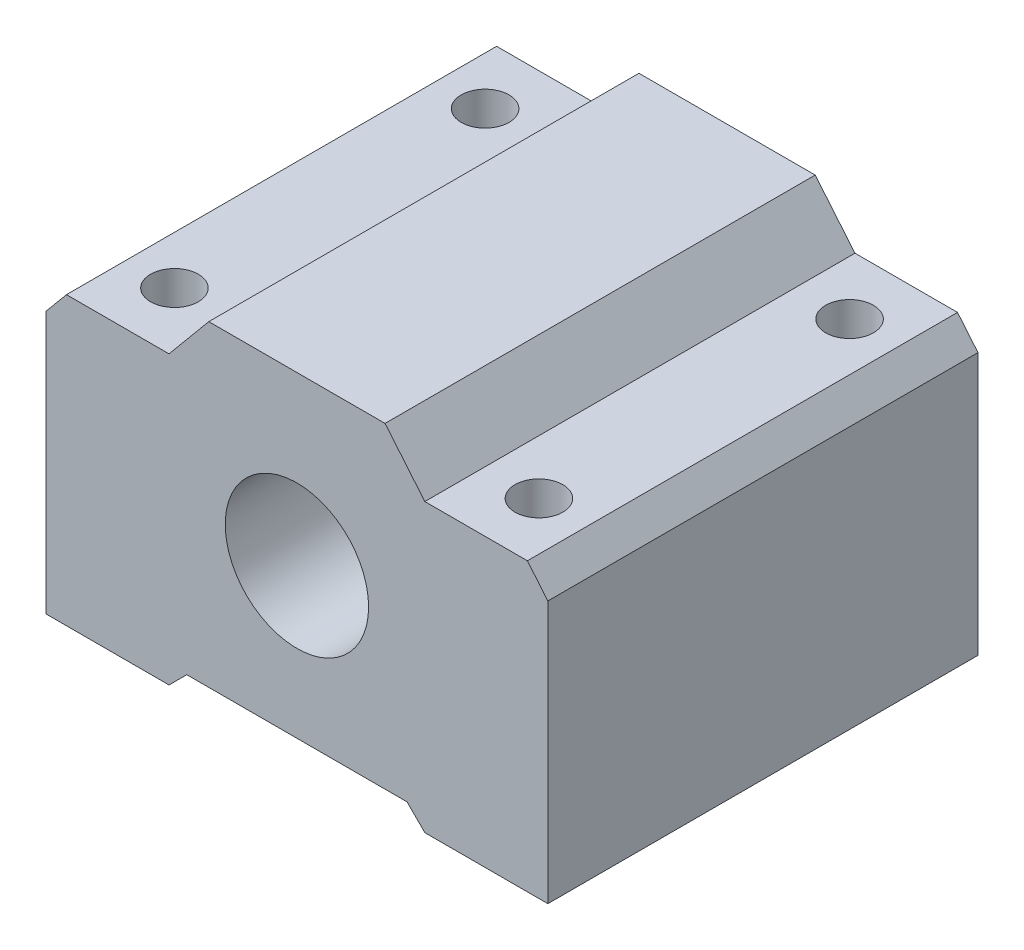
ISO-10303-21;
HEADER;
FILE_DESCRIPTION(('STEP AP214'),'2;1');
FILE_NAME('part.step','',(''),(''),'','','');
FILE_SCHEMA(('AUTOMOTIVE_DESIGN { 1 0 10303 214 1 1 1 1 }'));
ENDSEC;
DATA;
#1=APPLICATION_CONTEXT('core data for automotive mechanical design processes');
#2=APPLICATION_PROTOCOL_DEFINITION('international standard','automotive_design',2000,#1);
#3=PRODUCT_CONTEXT('',#1,'mechanical');
#4=PRODUCT('Part','Part','',(#3));
#5=PRODUCT_RELATED_PRODUCT_CATEGORY('part','',(#4));
#6=PRODUCT_DEFINITION_FORMATION('','',#4);
#7=PRODUCT_DEFINITION_CONTEXT('part definition',#1,'design');
#8=PRODUCT_DEFINITION('design','',#6,#7);
#9=PRODUCT_DEFINITION_SHAPE('','',#8);
#10=(LENGTH_UNIT() NAMED_UNIT(*) SI_UNIT(.MILLI.,.METRE.));
#11=(NAMED_UNIT(*) PLANE_ANGLE_UNIT() SI_UNIT($,.RADIAN.));
#12=(NAMED_UNIT(*) SI_UNIT($,.STERADIAN.) SOLID_ANGLE_UNIT());
#13=UNCERTAINTY_MEASURE_WITH_UNIT(LENGTH_MEASURE(1.E-05),#10,'distance_accuracy_value','');
#14=(GEOMETRIC_REPRESENTATION_CONTEXT(3) GLOBAL_UNCERTAINTY_ASSIGNED_CONTEXT((#13)) GLOBAL_UNIT_ASSIGNED_CONTEXT((#10,
#11,#12)) REPRESENTATION_CONTEXT('',''));
#15=CARTESIAN_POINT('',(0.,0.,0.));
#16=DIRECTION('',(0.,0.,1.));
#17=DIRECTION('',(1.,0.,0.));
#18=AXIS2_PLACEMENT_3D('',#15,#16,#17);
#19=CARTESIAN_POINT('',(0.,0.,36.));
#20=DIRECTION('',(0.,0.,1.));
#21=DIRECTION('',(1.,0.,0.));
#22=AXIS2_PLACEMENT_3D('',#19,#20,#21);
#23=PLANE('',#22);
#24=DIRECTION('',(0.,-1.,0.));
#25=VECTOR('',#24,1.);
#26=CARTESIAN_POINT('',(-21.,-14.,36.));
#27=LINE('',#26,#25);
#28=CARTESIAN_POINT('',(-21.,7.94169325448513,36.));
#29=VERTEX_POINT('',#28);
#30=CARTESIAN_POINT('',(-21.,-14.,36.));
#31=VERTEX_POINT('',#30);
#32=EDGE_CURVE('E194',#29,#31,#27,.T.);
#33=ORIENTED_EDGE('',*,*,#32,.T.);
#34=DIRECTION('',(1.,0.,0.));
#35=VECTOR('',#34,1.);
#36=CARTESIAN_POINT('',(-21.,-14.,36.));
#37=LINE('',#36,#35);
#38=CARTESIAN_POINT('',(-10.7048530087988,-14.,36.));
#39=VERTEX_POINT('',#38);
#40=EDGE_CURVE('E111',#31,#39,#37,.T.);
#41=ORIENTED_EDGE('',*,*,#40,.T.);
#42=DIRECTION('',(0.707106781186541,0.707106781186554,0.));
#43=VECTOR('',#42,1.);
#44=CARTESIAN_POINT('',(-10.7048530087988,-14.,36.));
#45=LINE('',#44,#43);
#46=CARTESIAN_POINT('',(-9.21653874939967,-12.5116857406009,36.));
#47=VERTEX_POINT('',#46);
#48=EDGE_CURVE('E227',#39,#47,#45,.T.);
#49=ORIENTED_EDGE('',*,*,#48,.T.);
#50=DIRECTION('',(1.,0.,0.));
#51=VECTOR('',#50,1.);
#52=CARTESIAN_POINT('',(-9.21653874939967,-12.5116857406009,36.));
#53=LINE('',#52,#51);
#54=CARTESIAN_POINT('',(9.21653874939962,-12.5116857406009,36.));
#55=VERTEX_POINT('',#54);
#56=EDGE_CURVE('E245',#47,#55,#53,.T.);
#57=ORIENTED_EDGE('',*,*,#56,.T.);
#58=DIRECTION('',(0.707106781186554,-0.707106781186541,0.));
#59=VECTOR('',#58,1.);
#60=CARTESIAN_POINT('',(10.7048530087988,-14.,36.));
#61=LINE('',#60,#59);
#62=CARTESIAN_POINT('',(10.7048530087988,-14.,36.));
#63=VERTEX_POINT('',#62);
#64=EDGE_CURVE('E242',#55,#63,#61,.T.);
#65=ORIENTED_EDGE('',*,*,#64,.T.);
#66=DIRECTION('',(1.,0.,0.));
#67=VECTOR('',#66,1.);
#68=CARTESIAN_POINT('',(12.1931672681979,-14.,36.));
#69=LINE('',#68,#67);
#70=CARTESIAN_POINT('',(21.,-14.,36.));
#71=VERTEX_POINT('',#70);
#72=EDGE_CURVE('E244',#63,#71,#69,.T.);
#73=ORIENTED_EDGE('',*,*,#72,.T.);
#74=DIRECTION('',(0.,1.,0.));
#75=VECTOR('',#74,1.);
#76=CARTESIAN_POINT('',(21.,-14.,36.));
#77=LINE('',#76,#75);
#78=CARTESIAN_POINT('',(21.,7.94169325448513,36.));
#79=VERTEX_POINT('',#78);
#80=EDGE_CURVE('E247',#71,#79,#77,.T.);
#81=ORIENTED_EDGE('',*,*,#80,.T.);
#82=DIRECTION('',(-0.639636680060431,0.768677381949846,0.));
#83=VECTOR('',#82,1.);
#84=CARTESIAN_POINT('',(19.2872287852318,10.,36.));
#85=LINE('',#84,#83);
#86=CARTESIAN_POINT('',(19.2872287852318,10.,36.));
#87=VERTEX_POINT('',#86);
#88=EDGE_CURVE('E253',#79,#87,#85,.T.);
#89=ORIENTED_EDGE('',*,*,#88,.T.);
#90=DIRECTION('',(-1.,0.,0.));
#91=VECTOR('',#90,1.);
#92=CARTESIAN_POINT('',(10.7048530087988,10.,36.));
#93=LINE('',#92,#91);
#94=CARTESIAN_POINT('',(10.7048530087988,10.,36.));
#95=VERTEX_POINT('',#94);
#96=EDGE_CURVE('E255',#87,#95,#93,.T.);
#97=ORIENTED_EDGE('',*,*,#96,.T.);
#98=DIRECTION('',(-0.63963668006043,0.768677381949847,0.));
#99=VECTOR('',#98,1.);
#100=CARTESIAN_POINT('',(7.37634773425612,14.,36.));
#101=LINE('',#100,#99);
#102=CARTESIAN_POINT('',(7.37634773425612,14.,36.));
#103=VERTEX_POINT('',#102);
#104=EDGE_CURVE('E257',#95,#103,#101,.T.);
#105=ORIENTED_EDGE('',*,*,#104,.T.);
#106=DIRECTION('',(-1.,0.,0.));
#107=VECTOR('',#106,1.);
#108=CARTESIAN_POINT('',(-7.3763477342561,14.,36.));
#109=LINE('',#108,#107);
#110=CARTESIAN_POINT('',(-7.3763477342561,14.,36.));
#111=VERTEX_POINT('',#110);
#112=EDGE_CURVE('E148',#103,#111,#109,.T.);
#113=ORIENTED_EDGE('',*,*,#112,.T.);
#114=DIRECTION('',(-0.639636680060431,-0.768677381949847,0.));
#115=VECTOR('',#114,1.);
#116=CARTESIAN_POINT('',(-7.3763477342561,14.,36.));
#117=LINE('',#116,#115);
#118=CARTESIAN_POINT('',(-10.7048530087988,9.99999999999999,36.));
#119=VERTEX_POINT('',#118);
#120=EDGE_CURVE('E142',#111,#119,#117,.T.);
#121=ORIENTED_EDGE('',*,*,#120,.T.);
#122=DIRECTION('',(-1.,0.,0.));
#123=VECTOR('',#122,1.);
#124=CARTESIAN_POINT('',(-10.7048530087988,9.99999999999999,36.));
#125=LINE('',#124,#123);
#126=CARTESIAN_POINT('',(-19.2872287852317,9.99999999999999,36.));
#127=VERTEX_POINT('',#126);
#128=EDGE_CURVE('E146',#119,#127,#125,.T.);
#129=ORIENTED_EDGE('',*,*,#128,.T.);
#130=DIRECTION('',(-0.639636680060431,-0.768677381949846,0.));
#131=VECTOR('',#130,1.);
#132=CARTESIAN_POINT('',(-19.2872287852317,9.99999999999999,36.));
#133=LINE('',#132,#131);
#134=EDGE_CURVE('E50',#127,#29,#133,.T.);
#135=ORIENTED_EDGE('',*,*,#134,.T.);
#136=EDGE_LOOP('',(#33,#41,#49,#57,#65,#73,#81,#89,#97,#105,#113,#121,#129,#135));
#137=FACE_BOUND('',#136,.T.);
#138=CARTESIAN_POINT('',(0.,0.,36.));
#139=DIRECTION('',(0.,0.,1.));
#140=DIRECTION('',(1.,0.,0.));
#141=AXIS2_PLACEMENT_3D('',#138,#139,#140);
#142=CIRCLE('',#141,6.);
#143=CARTESIAN_POINT('',(6.,0.,36.));
#144=VERTEX_POINT('',#143);
#145=EDGE_CURVE('E170',#144,#144,#142,.T.);
#146=ORIENTED_EDGE('',*,*,#145,.F.);
#147=EDGE_LOOP('',(#146));
#148=FACE_BOUND('',#147,.T.);
#149=ADVANCED_FACE('F33',(#137,#148),#23,.T.);
#150=CARTESIAN_POINT('',(0.,0.,0.));
#151=DIRECTION('',(0.,0.,1.));
#152=DIRECTION('',(1.,0.,0.));
#153=AXIS2_PLACEMENT_3D('',#150,#151,#152);
#154=PLANE('',#153);
#155=DIRECTION('',(0.,-1.,0.));
#156=VECTOR('',#155,1.);
#157=CARTESIAN_POINT('',(-21.,-14.,0.));
#158=LINE('',#157,#156);
#159=CARTESIAN_POINT('',(-21.,7.94169325448513,0.));
#160=VERTEX_POINT('',#159);
#161=CARTESIAN_POINT('',(-21.,-14.,0.));
#162=VERTEX_POINT('',#161);
#163=EDGE_CURVE('E166',#160,#162,#158,.T.);
#164=ORIENTED_EDGE('',*,*,#163,.F.);
#165=DIRECTION('',(-0.639636680060431,-0.768677381949846,0.));
#166=VECTOR('',#165,1.);
#167=CARTESIAN_POINT('',(-19.2872287852317,9.99999999999999,0.));
#168=LINE('',#167,#166);
#169=CARTESIAN_POINT('',(-19.2872287852317,9.99999999999999,0.));
#170=VERTEX_POINT('',#169);
#171=EDGE_CURVE('E103',#170,#160,#168,.T.);
#172=ORIENTED_EDGE('',*,*,#171,.F.);
#173=DIRECTION('',(-1.,0.,0.));
#174=VECTOR('',#173,1.);
#175=CARTESIAN_POINT('',(-10.7048530087988,9.99999999999999,0.));
#176=LINE('',#175,#174);
#177=CARTESIAN_POINT('',(-10.7048530087988,9.99999999999999,0.));
#178=VERTEX_POINT('',#177);
#179=EDGE_CURVE('E97',#178,#170,#176,.T.);
#180=ORIENTED_EDGE('',*,*,#179,.F.);
#181=DIRECTION('',(-0.639636680060431,-0.768677381949847,0.));
#182=VECTOR('',#181,1.);
#183=CARTESIAN_POINT('',(-7.3763477342561,14.,0.));
#184=LINE('',#183,#182);
#185=CARTESIAN_POINT('',(-7.3763477342561,14.,0.));
#186=VERTEX_POINT('',#185);
#187=EDGE_CURVE('E156',#186,#178,#184,.T.);
#188=ORIENTED_EDGE('',*,*,#187,.F.);
#189=DIRECTION('',(-1.,0.,0.));
#190=VECTOR('',#189,1.);
#191=CARTESIAN_POINT('',(-7.3763477342561,14.,0.));
#192=LINE('',#191,#190);
#193=CARTESIAN_POINT('',(7.37634773425612,14.,0.));
#194=VERTEX_POINT('',#193);
#195=EDGE_CURVE('E189',#194,#186,#192,.T.);
#196=ORIENTED_EDGE('',*,*,#195,.F.);
#197=DIRECTION('',(-0.63963668006043,0.768677381949847,0.));
#198=VECTOR('',#197,1.);
#199=CARTESIAN_POINT('',(7.37634773425612,14.,0.));
#200=LINE('',#199,#198);
#201=CARTESIAN_POINT('',(10.7048530087988,10.,0.));
#202=VERTEX_POINT('',#201);
#203=EDGE_CURVE('E187',#202,#194,#200,.T.);
#204=ORIENTED_EDGE('',*,*,#203,.F.);
#205=DIRECTION('',(-1.,0.,0.));
#206=VECTOR('',#205,1.);
#207=CARTESIAN_POINT('',(10.7048530087988,10.,0.));
#208=LINE('',#207,#206);
#209=CARTESIAN_POINT('',(19.2872287852318,10.,0.));
#210=VERTEX_POINT('',#209);
#211=EDGE_CURVE('E185',#210,#202,#208,.T.);
#212=ORIENTED_EDGE('',*,*,#211,.F.);
#213=DIRECTION('',(-0.639636680060431,0.768677381949846,0.));
#214=VECTOR('',#213,1.);
#215=CARTESIAN_POINT('',(19.2872287852318,10.,0.));
#216=LINE('',#215,#214);
#217=CARTESIAN_POINT('',(21.,7.94169325448513,0.));
#218=VERTEX_POINT('',#217);
#219=EDGE_CURVE('E183',#218,#210,#216,.T.);
#220=ORIENTED_EDGE('',*,*,#219,.F.);
#221=DIRECTION('',(0.,1.,0.));
#222=VECTOR('',#221,1.);
#223=CARTESIAN_POINT('',(21.,-14.,0.));
#224=LINE('',#223,#222);
#225=CARTESIAN_POINT('',(21.,-14.,0.));
#226=VERTEX_POINT('',#225);
#227=EDGE_CURVE('E181',#226,#218,#224,.T.);
#228=ORIENTED_EDGE('',*,*,#227,.F.);
#229=DIRECTION('',(1.,0.,0.));
#230=VECTOR('',#229,1.);
#231=CARTESIAN_POINT('',(12.1931672681979,-14.,0.));
#232=LINE('',#231,#230);
#233=CARTESIAN_POINT('',(10.7048530087988,-14.,0.));
#234=VERTEX_POINT('',#233);
#235=EDGE_CURVE('E179',#234,#226,#232,.T.);
#236=ORIENTED_EDGE('',*,*,#235,.F.);
#237=DIRECTION('',(0.707106781186554,-0.707106781186541,0.));
#238=VECTOR('',#237,1.);
#239=CARTESIAN_POINT('',(10.7048530087988,-14.,0.));
#240=LINE('',#239,#238);
#241=CARTESIAN_POINT('',(9.21653874939962,-12.5116857406009,0.));
#242=VERTEX_POINT('',#241);
#243=EDGE_CURVE('E176',#242,#234,#240,.T.);
#244=ORIENTED_EDGE('',*,*,#243,.F.);
#245=DIRECTION('',(1.,0.,0.));
#246=VECTOR('',#245,1.);
#247=CARTESIAN_POINT('',(-9.21653874939967,-12.5116857406009,0.));
#248=LINE('',#247,#246);
#249=CARTESIAN_POINT('',(-9.21653874939967,-12.5116857406009,0.));
#250=VERTEX_POINT('',#249);
#251=EDGE_CURVE('E174',#250,#242,#248,.T.);
#252=ORIENTED_EDGE('',*,*,#251,.F.);
#253=DIRECTION('',(0.707106781186541,0.707106781186554,0.));
#254=VECTOR('',#253,1.);
#255=CARTESIAN_POINT('',(-10.7048530087988,-14.,0.));
#256=LINE('',#255,#254);
#257=CARTESIAN_POINT('',(-10.7048530087988,-14.,0.));
#258=VERTEX_POINT('',#257);
#259=EDGE_CURVE('E172',#258,#250,#256,.T.);
#260=ORIENTED_EDGE('',*,*,#259,.F.);
#261=DIRECTION('',(1.,0.,0.));
#262=VECTOR('',#261,1.);
#263=CARTESIAN_POINT('',(-12.1931672681979,-14.,0.));
#264=LINE('',#263,#262);
#265=EDGE_CURVE('E169',#162,#258,#264,.T.);
#266=ORIENTED_EDGE('',*,*,#265,.F.);
#267=EDGE_LOOP('',(#164,#172,#180,#188,#196,#204,#212,#220,#228,#236,#244,#252,#260,#266));
#268=FACE_BOUND('',#267,.T.);
#269=CARTESIAN_POINT('',(0.,0.,0.));
#270=DIRECTION('',(0.,0.,1.));
#271=DIRECTION('',(1.,0.,0.));
#272=AXIS2_PLACEMENT_3D('',#269,#270,#271);
#273=CIRCLE('',#272,6.);
#274=CARTESIAN_POINT('',(6.,0.,0.));
#275=VERTEX_POINT('',#274);
#276=EDGE_CURVE('E335',#275,#275,#273,.T.);
#277=ORIENTED_EDGE('',*,*,#276,.T.);
#278=EDGE_LOOP('',(#277));
#279=FACE_BOUND('',#278,.T.);
#280=ADVANCED_FACE('F231',(#268,#279),#154,.F.);
#281=CARTESIAN_POINT('',(-21.,-14.,36.));
#282=DIRECTION('',(1.,0.,0.));
#283=DIRECTION('',(0.,1.,0.));
#284=AXIS2_PLACEMENT_3D('',#281,#282,#283);
#285=PLANE('',#284);
#286=ORIENTED_EDGE('',*,*,#163,.T.);
#287=DIRECTION('',(0.,0.,-1.));
#288=VECTOR('',#287,1.);
#289=CARTESIAN_POINT('',(-21.,-14.,36.));
#290=LINE('',#289,#288);
#291=EDGE_CURVE('E11',#31,#162,#290,.T.);
#292=ORIENTED_EDGE('',*,*,#291,.F.);
#293=ORIENTED_EDGE('',*,*,#32,.F.);
#294=DIRECTION('',(0.,0.,-1.));
#295=VECTOR('',#294,1.);
#296=CARTESIAN_POINT('',(-21.,7.94169325448513,36.));
#297=LINE('',#296,#295);
#298=EDGE_CURVE('E162',#29,#160,#297,.T.);
#299=ORIENTED_EDGE('',*,*,#298,.T.);
#300=EDGE_LOOP('',(#286,#292,#293,#299));
#301=FACE_BOUND('',#300,.T.);
#302=ADVANCED_FACE('F35',(#301),#285,.F.);
#303=CARTESIAN_POINT('',(-12.1931672681979,-14.,36.));
#304=DIRECTION('',(0.,1.,0.));
#305=DIRECTION('',(0.,0.,1.));
#306=AXIS2_PLACEMENT_3D('',#303,#304,#305);
#307=PLANE('',#306);
#308=CARTESIAN_POINT('',(-15.25,-14.,5.00000000000001));
#309=DIRECTION('',(0.,-1.,0.));
#310=DIRECTION('',(0.,0.,-1.));
#311=AXIS2_PLACEMENT_3D('',#308,#309,#310);
#312=CIRCLE('',#311,2.);
#313=CARTESIAN_POINT('',(-15.25,-14.,3.00000000000001));
#314=VERTEX_POINT('',#313);
#315=EDGE_CURVE('E310',#314,#314,#312,.T.);
#316=ORIENTED_EDGE('',*,*,#315,.F.);
#317=EDGE_LOOP('',(#316));
#318=FACE_BOUND('',#317,.T.);
#319=CARTESIAN_POINT('',(-15.25,-14.,31.));
#320=DIRECTION('',(0.,-1.,0.));
#321=DIRECTION('',(0.,0.,-1.));
#322=AXIS2_PLACEMENT_3D('',#319,#320,#321);
#323=CIRCLE('',#322,2.);
#324=CARTESIAN_POINT('',(-15.25,-14.,29.));
#325=VERTEX_POINT('',#324);
#326=EDGE_CURVE('E329',#325,#325,#323,.T.);
#327=ORIENTED_EDGE('',*,*,#326,.F.);
#328=EDGE_LOOP('',(#327));
#329=FACE_BOUND('',#328,.T.);
#330=ORIENTED_EDGE('',*,*,#265,.T.);
#331=DIRECTION('',(0.,0.,-1.));
#332=VECTOR('',#331,1.);
#333=CARTESIAN_POINT('',(-10.7048530087988,-14.,36.));
#334=LINE('',#333,#332);
#335=EDGE_CURVE('E42',#39,#258,#334,.T.);
#336=ORIENTED_EDGE('',*,*,#335,.F.);
#337=ORIENTED_EDGE('',*,*,#40,.F.);
#338=ORIENTED_EDGE('',*,*,#291,.T.);
#339=EDGE_LOOP('',(#330,#336,#337,#338));
#340=FACE_BOUND('',#339,.T.);
#341=ADVANCED_FACE('F349',(#318,#329,#340),#307,.F.);
#342=CARTESIAN_POINT('',(-10.7048530087988,-14.,36.));
#343=DIRECTION('',(-0.707106781186554,0.707106781186541,0.));
#344=DIRECTION('',(-0.707106781186541,-0.707106781186554,0.));
#345=AXIS2_PLACEMENT_3D('',#342,#343,#344);
#346=PLANE('',#345);
#347=ORIENTED_EDGE('',*,*,#259,.T.);
#348=DIRECTION('',(0.,0.,-1.));
#349=VECTOR('',#348,1.);
#350=CARTESIAN_POINT('',(-9.21653874939967,-12.5116857406009,36.));
#351=LINE('',#350,#349);
#352=EDGE_CURVE('E219',#47,#250,#351,.T.);
#353=ORIENTED_EDGE('',*,*,#352,.F.);
#354=ORIENTED_EDGE('',*,*,#48,.F.);
#355=ORIENTED_EDGE('',*,*,#335,.T.);
#356=EDGE_LOOP('',(#347,#353,#354,#355));
#357=FACE_BOUND('',#356,.T.);
#358=ADVANCED_FACE('F225',(#357),#346,.F.);
#359=CARTESIAN_POINT('',(-9.21653874939967,-12.5116857406009,36.));
#360=DIRECTION('',(0.,1.,0.));
#361=DIRECTION('',(0.,0.,1.));
#362=AXIS2_PLACEMENT_3D('',#359,#360,#361);
#363=PLANE('',#362);
#364=ORIENTED_EDGE('',*,*,#251,.T.);
#365=DIRECTION('',(0.,0.,-1.));
#366=VECTOR('',#365,1.);
#367=CARTESIAN_POINT('',(9.21653874939962,-12.5116857406009,36.));
#368=LINE('',#367,#366);
#369=EDGE_CURVE('E216',#55,#242,#368,.T.);
#370=ORIENTED_EDGE('',*,*,#369,.F.);
#371=ORIENTED_EDGE('',*,*,#56,.F.);
#372=ORIENTED_EDGE('',*,*,#352,.T.);
#373=EDGE_LOOP('',(#364,#370,#371,#372));
#374=FACE_BOUND('',#373,.T.);
#375=ADVANCED_FACE('F236',(#374),#363,.F.);
#376=CARTESIAN_POINT('',(10.7048530087988,-14.,36.));
#377=DIRECTION('',(0.707106781186541,0.707106781186554,0.));
#378=DIRECTION('',(-0.707106781186554,0.707106781186541,0.));
#379=AXIS2_PLACEMENT_3D('',#376,#377,#378);
#380=PLANE('',#379);
#381=ORIENTED_EDGE('',*,*,#243,.T.);
#382=DIRECTION('',(0.,0.,-1.));
#383=VECTOR('',#382,1.);
#384=CARTESIAN_POINT('',(10.7048530087988,-14.,36.));
#385=LINE('',#384,#383);
#386=EDGE_CURVE('E213',#63,#234,#385,.T.);
#387=ORIENTED_EDGE('',*,*,#386,.F.);
#388=ORIENTED_EDGE('',*,*,#64,.F.);
#389=ORIENTED_EDGE('',*,*,#369,.T.);
#390=EDGE_LOOP('',(#381,#387,#388,#389));
#391=FACE_BOUND('',#390,.T.);
#392=ADVANCED_FACE('F240',(#391),#380,.F.);
#393=CARTESIAN_POINT('',(12.1931672681979,-14.,36.));
#394=DIRECTION('',(0.,1.,0.));
#395=DIRECTION('',(0.,0.,1.));
#396=AXIS2_PLACEMENT_3D('',#393,#394,#395);
#397=PLANE('',#396);
#398=CARTESIAN_POINT('',(15.25,-14.,5.00000000000001));
#399=DIRECTION('',(0.,-1.,0.));
#400=DIRECTION('',(0.,0.,-1.));
#401=AXIS2_PLACEMENT_3D('',#398,#399,#400);
#402=CIRCLE('',#401,2.);
#403=CARTESIAN_POINT('',(15.25,-14.,3.00000000000001));
#404=VERTEX_POINT('',#403);
#405=EDGE_CURVE('E314',#404,#404,#402,.T.);
#406=ORIENTED_EDGE('',*,*,#405,.F.);
#407=EDGE_LOOP('',(#406));
#408=FACE_BOUND('',#407,.T.);
#409=CARTESIAN_POINT('',(15.25,-14.,31.));
#410=DIRECTION('',(0.,-1.,0.));
#411=DIRECTION('',(0.,0.,-1.));
#412=AXIS2_PLACEMENT_3D('',#409,#410,#411);
#413=CIRCLE('',#412,2.00000000000001);
#414=CARTESIAN_POINT('',(15.25,-14.,29.));
#415=VERTEX_POINT('',#414);
#416=EDGE_CURVE('E323',#415,#415,#413,.T.);
#417=ORIENTED_EDGE('',*,*,#416,.F.);
#418=EDGE_LOOP('',(#417));
#419=FACE_BOUND('',#418,.T.);
#420=ORIENTED_EDGE('',*,*,#235,.T.);
#421=DIRECTION('',(0.,0.,-1.));
#422=VECTOR('',#421,1.);
#423=CARTESIAN_POINT('',(21.,-14.,36.));
#424=LINE('',#423,#422);
#425=EDGE_CURVE('E210',#71,#226,#424,.T.);
#426=ORIENTED_EDGE('',*,*,#425,.F.);
#427=ORIENTED_EDGE('',*,*,#72,.F.);
#428=ORIENTED_EDGE('',*,*,#386,.T.);
#429=EDGE_LOOP('',(#420,#426,#427,#428));
#430=FACE_BOUND('',#429,.T.);
#431=ADVANCED_FACE('F362',(#408,#419,#430),#397,.F.);
#432=CARTESIAN_POINT('',(21.,-14.,36.));
#433=DIRECTION('',(-1.,0.,0.));
#434=DIRECTION('',(0.,-1.,0.));
#435=AXIS2_PLACEMENT_3D('',#432,#433,#434);
#436=PLANE('',#435);
#437=ORIENTED_EDGE('',*,*,#227,.T.);
#438=DIRECTION('',(0.,0.,-1.));
#439=VECTOR('',#438,1.);
#440=CARTESIAN_POINT('',(21.,7.94169325448513,36.));
#441=LINE('',#440,#439);
#442=EDGE_CURVE('E207',#79,#218,#441,.T.);
#443=ORIENTED_EDGE('',*,*,#442,.F.);
#444=ORIENTED_EDGE('',*,*,#80,.F.);
#445=ORIENTED_EDGE('',*,*,#425,.T.);
#446=EDGE_LOOP('',(#437,#443,#444,#445));
#447=FACE_BOUND('',#446,.T.);
#448=ADVANCED_FACE('F365',(#447),#436,.F.);
#449=CARTESIAN_POINT('',(19.2872287852318,10.,36.));
#450=DIRECTION('',(-0.768677381949846,-0.639636680060431,0.));
#451=DIRECTION('',(0.639636680060431,-0.768677381949846,0.));
#452=AXIS2_PLACEMENT_3D('',#449,#450,#451);
#453=PLANE('',#452);
#454=ORIENTED_EDGE('',*,*,#219,.T.);
#455=DIRECTION('',(0.,0.,-1.));
#456=VECTOR('',#455,1.);
#457=CARTESIAN_POINT('',(19.2872287852318,10.,36.));
#458=LINE('',#457,#456);
#459=EDGE_CURVE('E204',#87,#210,#458,.T.);
#460=ORIENTED_EDGE('',*,*,#459,.F.);
#461=ORIENTED_EDGE('',*,*,#88,.F.);
#462=ORIENTED_EDGE('',*,*,#442,.T.);
#463=EDGE_LOOP('',(#454,#460,#461,#462));
#464=FACE_BOUND('',#463,.T.);
#465=ADVANCED_FACE('F369',(#464),#453,.F.);
#466=CARTESIAN_POINT('',(10.7048530087988,10.,36.));
#467=DIRECTION('',(0.,-1.,0.));
#468=DIRECTION('',(1.,0.,0.));
#469=AXIS2_PLACEMENT_3D('',#466,#467,#468);
#470=PLANE('',#469);
#471=CARTESIAN_POINT('',(15.25,10.,5.00000000000001));
#472=DIRECTION('',(0.,-1.,0.));
#473=DIRECTION('',(1.,0.,0.));
#474=AXIS2_PLACEMENT_3D('',#471,#472,#473);
#475=CIRCLE('',#474,2.);
#476=CARTESIAN_POINT('',(17.25,10.,5.00000000000001));
#477=VERTEX_POINT('',#476);
#478=EDGE_CURVE('E317',#477,#477,#475,.F.);
#479=ORIENTED_EDGE('',*,*,#478,.F.);
#480=EDGE_LOOP('',(#479));
#481=FACE_BOUND('',#480,.T.);
#482=CARTESIAN_POINT('',(15.25,10.,31.));
#483=DIRECTION('',(0.,-1.,0.));
#484=DIRECTION('',(1.,0.,0.));
#485=AXIS2_PLACEMENT_3D('',#482,#483,#484);
#486=CIRCLE('',#485,2.00000000000001);
#487=CARTESIAN_POINT('',(17.25,10.,31.));
#488=VERTEX_POINT('',#487);
#489=EDGE_CURVE('E326',#488,#488,#486,.F.);
#490=ORIENTED_EDGE('',*,*,#489,.F.);
#491=EDGE_LOOP('',(#490));
#492=FACE_BOUND('',#491,.T.);
#493=ORIENTED_EDGE('',*,*,#211,.T.);
#494=DIRECTION('',(0.,0.,-1.));
#495=VECTOR('',#494,1.);
#496=CARTESIAN_POINT('',(10.7048530087988,10.,36.));
#497=LINE('',#496,#495);
#498=EDGE_CURVE('E201',#95,#202,#497,.T.);
#499=ORIENTED_EDGE('',*,*,#498,.F.);
#500=ORIENTED_EDGE('',*,*,#96,.F.);
#501=ORIENTED_EDGE('',*,*,#459,.T.);
#502=EDGE_LOOP('',(#493,#499,#500,#501));
#503=FACE_BOUND('',#502,.T.);
#504=ADVANCED_FACE('F373',(#481,#492,#503),#470,.F.);
#505=CARTESIAN_POINT('',(7.37634773425612,14.,36.));
#506=DIRECTION('',(-0.768677381949847,-0.63963668006043,0.));
#507=DIRECTION('',(0.63963668006043,-0.768677381949847,0.));
#508=AXIS2_PLACEMENT_3D('',#505,#506,#507);
#509=PLANE('',#508);
#510=ORIENTED_EDGE('',*,*,#203,.T.);
#511=DIRECTION('',(0.,0.,-1.));
#512=VECTOR('',#511,1.);
#513=CARTESIAN_POINT('',(7.37634773425612,14.,36.));
#514=LINE('',#513,#512);
#515=EDGE_CURVE('E198',#103,#194,#514,.T.);
#516=ORIENTED_EDGE('',*,*,#515,.F.);
#517=ORIENTED_EDGE('',*,*,#104,.F.);
#518=ORIENTED_EDGE('',*,*,#498,.T.);
#519=EDGE_LOOP('',(#510,#516,#517,#518));
#520=FACE_BOUND('',#519,.T.);
#521=ADVANCED_FACE('F263',(#520),#509,.F.);
#522=CARTESIAN_POINT('',(-7.3763477342561,14.,36.));
#523=DIRECTION('',(0.,-1.,0.));
#524=DIRECTION('',(1.,0.,0.));
#525=AXIS2_PLACEMENT_3D('',#522,#523,#524);
#526=PLANE('',#525);
#527=ORIENTED_EDGE('',*,*,#195,.T.);
#528=DIRECTION('',(0.,0.,-1.));
#529=VECTOR('',#528,1.);
#530=CARTESIAN_POINT('',(-7.3763477342561,14.,36.));
#531=LINE('',#530,#529);
#532=EDGE_CURVE('E157',#111,#186,#531,.T.);
#533=ORIENTED_EDGE('',*,*,#532,.F.);
#534=ORIENTED_EDGE('',*,*,#112,.F.);
#535=ORIENTED_EDGE('',*,*,#515,.T.);
#536=EDGE_LOOP('',(#527,#533,#534,#535));
#537=FACE_BOUND('',#536,.T.);
#538=ADVANCED_FACE('F267',(#537),#526,.F.);
#539=CARTESIAN_POINT('',(-7.3763477342561,14.,36.));
#540=DIRECTION('',(0.768677381949846,-0.639636680060431,0.));
#541=DIRECTION('',(0.639636680060431,0.768677381949847,0.));
#542=AXIS2_PLACEMENT_3D('',#539,#540,#541);
#543=PLANE('',#542);
#544=ORIENTED_EDGE('',*,*,#187,.T.);
#545=DIRECTION('',(0.,0.,-1.));
#546=VECTOR('',#545,1.);
#547=CARTESIAN_POINT('',(-10.7048530087988,9.99999999999999,36.));
#548=LINE('',#547,#546);
#549=EDGE_CURVE('E153',#119,#178,#548,.T.);
#550=ORIENTED_EDGE('',*,*,#549,.F.);
#551=ORIENTED_EDGE('',*,*,#120,.F.);
#552=ORIENTED_EDGE('',*,*,#532,.T.);
#553=EDGE_LOOP('',(#544,#550,#551,#552));
#554=FACE_BOUND('',#553,.T.);
#555=ADVANCED_FACE('F154',(#554),#543,.F.);
#556=CARTESIAN_POINT('',(-10.7048530087988,9.99999999999999,36.));
#557=DIRECTION('',(0.,-1.,0.));
#558=DIRECTION('',(1.,0.,0.));
#559=AXIS2_PLACEMENT_3D('',#556,#557,#558);
#560=PLANE('',#559);
#561=CARTESIAN_POINT('',(-15.25,9.99999999999999,5.00000000000001));
#562=DIRECTION('',(0.,-1.,0.));
#563=DIRECTION('',(1.,0.,0.));
#564=AXIS2_PLACEMENT_3D('',#561,#562,#563);
#565=CIRCLE('',#564,2.);
#566=CARTESIAN_POINT('',(-13.25,9.99999999999999,5.00000000000001));
#567=VERTEX_POINT('',#566);
#568=EDGE_CURVE('E313',#567,#567,#565,.F.);
#569=ORIENTED_EDGE('',*,*,#568,.F.);
#570=EDGE_LOOP('',(#569));
#571=FACE_BOUND('',#570,.T.);
#572=CARTESIAN_POINT('',(-15.25,9.99999999999999,31.));
#573=DIRECTION('',(0.,-1.,0.));
#574=DIRECTION('',(1.,0.,0.));
#575=AXIS2_PLACEMENT_3D('',#572,#573,#574);
#576=CIRCLE('',#575,2.);
#577=CARTESIAN_POINT('',(-13.25,9.99999999999999,31.));
#578=VERTEX_POINT('',#577);
#579=EDGE_CURVE('E332',#578,#578,#576,.F.);
#580=ORIENTED_EDGE('',*,*,#579,.F.);
#581=EDGE_LOOP('',(#580));
#582=FACE_BOUND('',#581,.T.);
#583=ORIENTED_EDGE('',*,*,#179,.T.);
#584=DIRECTION('',(0.,0.,-1.));
#585=VECTOR('',#584,1.);
#586=CARTESIAN_POINT('',(-19.2872287852317,9.99999999999999,36.));
#587=LINE('',#586,#585);
#588=EDGE_CURVE('E158',#127,#170,#587,.T.);
#589=ORIENTED_EDGE('',*,*,#588,.F.);
#590=ORIENTED_EDGE('',*,*,#128,.F.);
#591=ORIENTED_EDGE('',*,*,#549,.T.);
#592=EDGE_LOOP('',(#583,#589,#590,#591));
#593=FACE_BOUND('',#592,.T.);
#594=ADVANCED_FACE('F160',(#571,#582,#593),#560,.F.);
#595=CARTESIAN_POINT('',(-19.2872287852317,9.99999999999999,36.));
#596=DIRECTION('',(0.768677381949846,-0.639636680060431,0.));
#597=DIRECTION('',(0.639636680060431,0.768677381949846,0.));
#598=AXIS2_PLACEMENT_3D('',#595,#596,#597);
#599=PLANE('',#598);
#600=ORIENTED_EDGE('',*,*,#171,.T.);
#601=ORIENTED_EDGE('',*,*,#298,.F.);
#602=ORIENTED_EDGE('',*,*,#134,.F.);
#603=ORIENTED_EDGE('',*,*,#588,.T.);
#604=EDGE_LOOP('',(#600,#601,#602,#603));
#605=FACE_BOUND('',#604,.T.);
#606=ADVANCED_FACE('F271',(#605),#599,.F.);
#607=CARTESIAN_POINT('',(0.,0.,36.));
#608=DIRECTION('',(0.,0.,-1.));
#609=DIRECTION('',(-1.,0.,0.));
#610=AXIS2_PLACEMENT_3D('',#607,#608,#609);
#611=CYLINDRICAL_SURFACE('',#610,6.);
#612=ORIENTED_EDGE('',*,*,#145,.T.);
#613=EDGE_LOOP('',(#612));
#614=FACE_BOUND('',#613,.T.);
#615=ORIENTED_EDGE('',*,*,#276,.F.);
#616=EDGE_LOOP('',(#615));
#617=FACE_BOUND('',#616,.T.);
#618=ADVANCED_FACE('F273',(#614,#617),#611,.F.);
#619=CARTESIAN_POINT('',(-15.25,14.001,31.));
#620=DIRECTION('',(0.,-1.,0.));
#621=DIRECTION('',(0.,0.,-1.));
#622=AXIS2_PLACEMENT_3D('',#619,#620,#621);
#623=CYLINDRICAL_SURFACE('',#622,2.);
#624=ORIENTED_EDGE('',*,*,#326,.T.);
#625=EDGE_LOOP('',(#624));
#626=FACE_BOUND('',#625,.T.);
#627=ORIENTED_EDGE('',*,*,#579,.T.);
#628=EDGE_LOOP('',(#627));
#629=FACE_BOUND('',#628,.T.);
#630=ADVANCED_FACE('F279',(#626,#629),#623,.F.);
#631=CARTESIAN_POINT('',(15.25,14.001,31.));
#632=DIRECTION('',(0.,-1.,0.));
#633=DIRECTION('',(0.,0.,-1.));
#634=AXIS2_PLACEMENT_3D('',#631,#632,#633);
#635=CYLINDRICAL_SURFACE('',#634,2.00000000000001);
#636=ORIENTED_EDGE('',*,*,#416,.T.);
#637=EDGE_LOOP('',(#636));
#638=FACE_BOUND('',#637,.T.);
#639=ORIENTED_EDGE('',*,*,#489,.T.);
#640=EDGE_LOOP('',(#639));
#641=FACE_BOUND('',#640,.T.);
#642=ADVANCED_FACE('F293',(#638,#641),#635,.F.);
#643=CARTESIAN_POINT('',(15.25,14.001,5.00000000000001));
#644=DIRECTION('',(0.,-1.,0.));
#645=DIRECTION('',(0.,0.,-1.));
#646=AXIS2_PLACEMENT_3D('',#643,#644,#645);
#647=CYLINDRICAL_SURFACE('',#646,2.);
#648=ORIENTED_EDGE('',*,*,#405,.T.);
#649=EDGE_LOOP('',(#648));
#650=FACE_BOUND('',#649,.T.);
#651=ORIENTED_EDGE('',*,*,#478,.T.);
#652=EDGE_LOOP('',(#651));
#653=FACE_BOUND('',#652,.T.);
#654=ADVANCED_FACE('F297',(#650,#653),#647,.F.);
#655=CARTESIAN_POINT('',(-15.25,14.001,5.00000000000001));
#656=DIRECTION('',(0.,-1.,0.));
#657=DIRECTION('',(0.,0.,-1.));
#658=AXIS2_PLACEMENT_3D('',#655,#656,#657);
#659=CYLINDRICAL_SURFACE('',#658,2.);
#660=ORIENTED_EDGE('',*,*,#315,.T.);
#661=EDGE_LOOP('',(#660));
#662=FACE_BOUND('',#661,.T.);
#663=ORIENTED_EDGE('',*,*,#568,.T.);
#664=EDGE_LOOP('',(#663));
#665=FACE_BOUND('',#664,.T.);
#666=ADVANCED_FACE('F301',(#662,#665),#659,.F.);
#667=CLOSED_SHELL('',(#149,#280,#302,#341,#358,#375,#392,#431,#448,#465,#504,#521,#538,#555,
#594,#606,#618,#630,#642,#654,#666));
#668=MANIFOLD_SOLID_BREP('B2',#667);
#669=ADVANCED_BREP_SHAPE_REPRESENTATION('',(#18,#668),#14);
#670=SHAPE_DEFINITION_REPRESENTATION(#9,#669);
ENDSEC;
END-ISO-10303-21;
